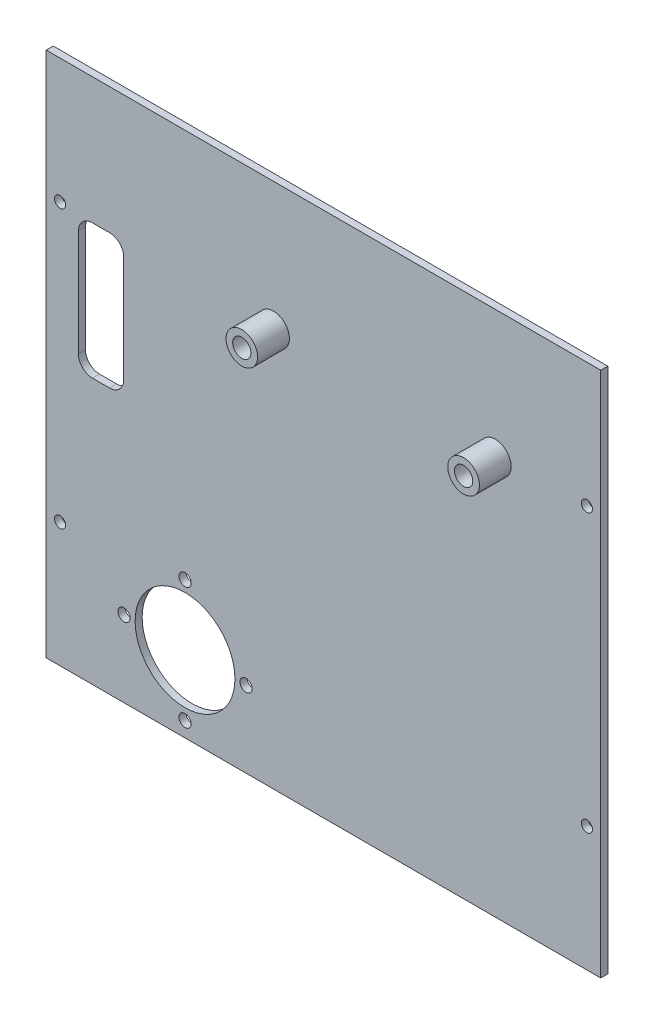
ISO-10303-21;
HEADER;
FILE_DESCRIPTION(('STEP AP214'),'2;1');
FILE_NAME('part.step','',(''),(''),'','','');
FILE_SCHEMA(('AUTOMOTIVE_DESIGN { 1 0 10303 214 1 1 1 1 }'));
ENDSEC;
DATA;
#1=APPLICATION_CONTEXT('core data for automotive mechanical design processes');
#2=APPLICATION_PROTOCOL_DEFINITION('international standard','automotive_design',2000,#1);
#3=PRODUCT_CONTEXT('',#1,'mechanical');
#4=PRODUCT('Part','Part','',(#3));
#5=PRODUCT_RELATED_PRODUCT_CATEGORY('part','',(#4));
#6=PRODUCT_DEFINITION_FORMATION('','',#4);
#7=PRODUCT_DEFINITION_CONTEXT('part definition',#1,'design');
#8=PRODUCT_DEFINITION('design','',#6,#7);
#9=PRODUCT_DEFINITION_SHAPE('','',#8);
#10=(LENGTH_UNIT() NAMED_UNIT(*) SI_UNIT(.MILLI.,.METRE.));
#11=(NAMED_UNIT(*) PLANE_ANGLE_UNIT() SI_UNIT($,.RADIAN.));
#12=(NAMED_UNIT(*) SI_UNIT($,.STERADIAN.) SOLID_ANGLE_UNIT());
#13=UNCERTAINTY_MEASURE_WITH_UNIT(LENGTH_MEASURE(1.E-05),#10,'distance_accuracy_value','');
#14=(GEOMETRIC_REPRESENTATION_CONTEXT(3) GLOBAL_UNCERTAINTY_ASSIGNED_CONTEXT((#13)) GLOBAL_UNIT_ASSIGNED_CONTEXT((#10,
#11,#12)) REPRESENTATION_CONTEXT('',''));
#15=CARTESIAN_POINT('',(0.,0.,0.));
#16=DIRECTION('',(0.,0.,1.));
#17=DIRECTION('',(1.,0.,0.));
#18=AXIS2_PLACEMENT_3D('',#15,#16,#17);
#19=CARTESIAN_POINT('',(0.,0.,1.27));
#20=DIRECTION('',(0.,0.,1.));
#21=DIRECTION('',(1.,0.,0.));
#22=AXIS2_PLACEMENT_3D('',#19,#20,#21);
#23=PLANE('',#22);
#24=CARTESIAN_POINT('',(11.4355880883671,51.6657368288596,1.27));
#25=DIRECTION('',(0.,0.,1.));
#26=DIRECTION('',(1.,0.,0.));
#27=AXIS2_PLACEMENT_3D('',#24,#25,#26);
#28=CIRCLE('',#27,2.54);
#29=CARTESIAN_POINT('',(11.4355880883671,49.1257368288596,1.27));
#30=VERTEX_POINT('',#29);
#31=CARTESIAN_POINT('',(13.9755880883671,51.6657368288596,1.27));
#32=VERTEX_POINT('',#31);
#33=EDGE_CURVE('E72',#30,#32,#28,.T.);
#34=ORIENTED_EDGE('',*,*,#33,.F.);
#35=DIRECTION('',(1.,0.,0.));
#36=VECTOR('',#35,1.);
#37=CARTESIAN_POINT('',(11.4355880883671,49.1257368288596,1.27));
#38=LINE('',#37,#36);
#39=CARTESIAN_POINT('',(8.34110605066527,49.1257368288596,1.27));
#40=VERTEX_POINT('',#39);
#41=EDGE_CURVE('E179',#40,#30,#38,.T.);
#42=ORIENTED_EDGE('',*,*,#41,.F.);
#43=CARTESIAN_POINT('',(8.34110605066525,51.6657368288596,1.27));
#44=DIRECTION('',(0.,0.,1.));
#45=DIRECTION('',(1.,0.,0.));
#46=AXIS2_PLACEMENT_3D('',#43,#44,#45);
#47=CIRCLE('',#46,2.54);
#48=CARTESIAN_POINT('',(5.80110605066525,51.6657368288596,1.27));
#49=VERTEX_POINT('',#48);
#50=EDGE_CURVE('E176',#49,#40,#47,.T.);
#51=ORIENTED_EDGE('',*,*,#50,.F.);
#52=DIRECTION('',(0.,-1.,0.));
#53=VECTOR('',#52,1.);
#54=CARTESIAN_POINT('',(5.80110605066525,51.6657368288596,1.27));
#55=LINE('',#54,#53);
#56=CARTESIAN_POINT('',(5.8011060506654,70.8373046116891,1.27));
#57=VERTEX_POINT('',#56);
#58=EDGE_CURVE('E173',#57,#49,#55,.T.);
#59=ORIENTED_EDGE('',*,*,#58,.F.);
#60=CARTESIAN_POINT('',(8.3411060506654,70.8373046116891,1.27));
#61=DIRECTION('',(0.,0.,1.));
#62=DIRECTION('',(1.,0.,0.));
#63=AXIS2_PLACEMENT_3D('',#60,#61,#62);
#64=CIRCLE('',#63,2.54);
#65=CARTESIAN_POINT('',(8.3411060506654,73.3773046116891,1.27));
#66=VERTEX_POINT('',#65);
#67=EDGE_CURVE('E167',#66,#57,#64,.T.);
#68=ORIENTED_EDGE('',*,*,#67,.F.);
#69=DIRECTION('',(-1.,0.,0.));
#70=VECTOR('',#69,1.);
#71=CARTESIAN_POINT('',(8.3411060506654,73.3773046116891,1.27));
#72=LINE('',#71,#70);
#73=CARTESIAN_POINT('',(11.435588088367,73.3773046116891,1.27));
#74=VERTEX_POINT('',#73);
#75=EDGE_CURVE('E165',#74,#66,#72,.T.);
#76=ORIENTED_EDGE('',*,*,#75,.F.);
#77=CARTESIAN_POINT('',(11.435588088367,70.8373046116891,1.27));
#78=DIRECTION('',(0.,0.,1.));
#79=DIRECTION('',(-1.,0.,0.));
#80=AXIS2_PLACEMENT_3D('',#77,#78,#79);
#81=CIRCLE('',#80,2.54);
#82=CARTESIAN_POINT('',(13.975588088367,70.8373046116891,1.27));
#83=VERTEX_POINT('',#82);
#84=EDGE_CURVE('E149',#83,#74,#81,.T.);
#85=ORIENTED_EDGE('',*,*,#84,.F.);
#86=DIRECTION('',(0.,1.,0.));
#87=VECTOR('',#86,1.);
#88=CARTESIAN_POINT('',(13.975588088367,70.8373046116891,1.27));
#89=LINE('',#88,#87);
#90=EDGE_CURVE('E158',#32,#83,#89,.T.);
#91=ORIENTED_EDGE('',*,*,#90,.F.);
#92=EDGE_LOOP('',(#34,#42,#51,#59,#68,#76,#85,#91));
#93=FACE_BOUND('',#92,.T.);
#94=CARTESIAN_POINT('',(97.5,73.73,1.27));
#95=DIRECTION('',(0.,0.,1.));
#96=DIRECTION('',(1.,0.,0.));
#97=AXIS2_PLACEMENT_3D('',#94,#95,#96);
#98=CIRCLE('',#97,1.00000000000001);
#99=CARTESIAN_POINT('',(98.5,73.73,1.27));
#100=VERTEX_POINT('',#99);
#101=EDGE_CURVE('E215',#100,#100,#98,.T.);
#102=ORIENTED_EDGE('',*,*,#101,.F.);
#103=EDGE_LOOP('',(#102));
#104=FACE_BOUND('',#103,.T.);
#105=CARTESIAN_POINT('',(97.5,23.73,1.27));
#106=DIRECTION('',(0.,0.,1.));
#107=DIRECTION('',(1.,0.,0.));
#108=AXIS2_PLACEMENT_3D('',#105,#106,#107);
#109=CIRCLE('',#108,0.999999999999998);
#110=CARTESIAN_POINT('',(98.5,23.73,1.27));
#111=VERTEX_POINT('',#110);
#112=EDGE_CURVE('E212',#111,#111,#109,.T.);
#113=ORIENTED_EDGE('',*,*,#112,.F.);
#114=EDGE_LOOP('',(#113));
#115=FACE_BOUND('',#114,.T.);
#116=CARTESIAN_POINT('',(2.49999999999999,23.73,1.27));
#117=DIRECTION('',(0.,0.,1.));
#118=DIRECTION('',(1.,0.,0.));
#119=AXIS2_PLACEMENT_3D('',#116,#117,#118);
#120=CIRCLE('',#119,0.999999999999999);
#121=CARTESIAN_POINT('',(3.49999999999999,23.73,1.27));
#122=VERTEX_POINT('',#121);
#123=EDGE_CURVE('E209',#122,#122,#120,.T.);
#124=ORIENTED_EDGE('',*,*,#123,.F.);
#125=EDGE_LOOP('',(#124));
#126=FACE_BOUND('',#125,.T.);
#127=CARTESIAN_POINT('',(2.5,73.73,1.27));
#128=DIRECTION('',(0.,0.,1.));
#129=DIRECTION('',(1.,0.,0.));
#130=AXIS2_PLACEMENT_3D('',#127,#128,#129);
#131=CIRCLE('',#130,1.);
#132=CARTESIAN_POINT('',(3.5,73.73,1.27));
#133=VERTEX_POINT('',#132);
#134=EDGE_CURVE('E206',#133,#133,#131,.T.);
#135=ORIENTED_EDGE('',*,*,#134,.F.);
#136=EDGE_LOOP('',(#135));
#137=FACE_BOUND('',#136,.T.);
#138=CARTESIAN_POINT('',(25.031645401981,4.,1.27));
#139=DIRECTION('',(0.,0.,1.));
#140=DIRECTION('',(1.,0.,0.));
#141=AXIS2_PLACEMENT_3D('',#138,#139,#140);
#142=CIRCLE('',#141,1.1);
#143=CARTESIAN_POINT('',(26.131645401981,4.,1.27));
#144=VERTEX_POINT('',#143);
#145=EDGE_CURVE('E245',#144,#144,#142,.T.);
#146=ORIENTED_EDGE('',*,*,#145,.F.);
#147=EDGE_LOOP('',(#146));
#148=FACE_BOUND('',#147,.T.);
#149=DIRECTION('',(0.,1.,0.));
#150=VECTOR('',#149,1.);
#151=CARTESIAN_POINT('',(100.,0.,1.27));
#152=LINE('',#151,#150);
#153=CARTESIAN_POINT('',(100.,1.27,1.27));
#154=VERTEX_POINT('',#153);
#155=CARTESIAN_POINT('',(100.,96.19,1.27));
#156=VERTEX_POINT('',#155);
#157=EDGE_CURVE('E275',#154,#156,#152,.T.);
#158=ORIENTED_EDGE('',*,*,#157,.T.);
#159=DIRECTION('',(-1.,0.,0.));
#160=VECTOR('',#159,1.);
#161=CARTESIAN_POINT('',(0.,96.19,1.27));
#162=LINE('',#161,#160);
#163=CARTESIAN_POINT('',(0.,96.19,1.27));
#164=VERTEX_POINT('',#163);
#165=EDGE_CURVE('E278',#156,#164,#162,.T.);
#166=ORIENTED_EDGE('',*,*,#165,.T.);
#167=DIRECTION('',(0.,1.,0.));
#168=VECTOR('',#167,1.);
#169=CARTESIAN_POINT('',(0.,0.,1.27));
#170=LINE('',#169,#168);
#171=CARTESIAN_POINT('',(0.,1.27,1.27));
#172=VERTEX_POINT('',#171);
#173=EDGE_CURVE('E281',#172,#164,#170,.T.);
#174=ORIENTED_EDGE('',*,*,#173,.F.);
#175=DIRECTION('',(1.,0.,0.));
#176=VECTOR('',#175,1.);
#177=CARTESIAN_POINT('',(0.,1.27,1.27));
#178=LINE('',#177,#176);
#179=EDGE_CURVE('E284',#172,#154,#178,.T.);
#180=ORIENTED_EDGE('',*,*,#179,.T.);
#181=EDGE_LOOP('',(#158,#166,#174,#180));
#182=FACE_BOUND('',#181,.T.);
#183=CARTESIAN_POINT('',(81.00001,73.0548198698189,1.27));
#184=DIRECTION('',(0.,0.,1.));
#185=DIRECTION('',(1.,0.,0.));
#186=AXIS2_PLACEMENT_3D('',#183,#184,#185);
#187=CIRCLE('',#186,2.84999999999999);
#188=CARTESIAN_POINT('',(83.85001,73.0548198698189,1.27));
#189=VERTEX_POINT('',#188);
#190=EDGE_CURVE('E268',#189,#189,#187,.T.);
#191=ORIENTED_EDGE('',*,*,#190,.F.);
#192=EDGE_LOOP('',(#191));
#193=FACE_BOUND('',#192,.T.);
#194=CARTESIAN_POINT('',(41.00001,73.0548198698189,1.27));
#195=DIRECTION('',(0.,0.,1.));
#196=DIRECTION('',(1.,0.,0.));
#197=AXIS2_PLACEMENT_3D('',#194,#195,#196);
#198=CIRCLE('',#197,2.85000000000001);
#199=CARTESIAN_POINT('',(43.85001,73.0548198698189,1.27));
#200=VERTEX_POINT('',#199);
#201=EDGE_CURVE('E264',#200,#200,#198,.T.);
#202=ORIENTED_EDGE('',*,*,#201,.F.);
#203=EDGE_LOOP('',(#202));
#204=FACE_BOUND('',#203,.T.);
#205=CARTESIAN_POINT('',(14.031645401981,15.,1.27));
#206=DIRECTION('',(0.,0.,1.));
#207=DIRECTION('',(1.,0.,0.));
#208=AXIS2_PLACEMENT_3D('',#205,#206,#207);
#209=CIRCLE('',#208,1.1);
#210=CARTESIAN_POINT('',(15.131645401981,15.,1.27));
#211=VERTEX_POINT('',#210);
#212=EDGE_CURVE('E222',#211,#211,#209,.T.);
#213=ORIENTED_EDGE('',*,*,#212,.F.);
#214=EDGE_LOOP('',(#213));
#215=FACE_BOUND('',#214,.T.);
#216=CARTESIAN_POINT('',(25.031645401981,26.,1.27));
#217=DIRECTION('',(0.,0.,1.));
#218=DIRECTION('',(1.,0.,0.));
#219=AXIS2_PLACEMENT_3D('',#216,#217,#218);
#220=CIRCLE('',#219,1.1);
#221=CARTESIAN_POINT('',(26.131645401981,26.,1.27));
#222=VERTEX_POINT('',#221);
#223=EDGE_CURVE('E236',#222,#222,#220,.T.);
#224=ORIENTED_EDGE('',*,*,#223,.F.);
#225=EDGE_LOOP('',(#224));
#226=FACE_BOUND('',#225,.T.);
#227=CARTESIAN_POINT('',(36.031645401981,15.,1.27));
#228=DIRECTION('',(0.,0.,1.));
#229=DIRECTION('',(1.,0.,0.));
#230=AXIS2_PLACEMENT_3D('',#227,#228,#229);
#231=CIRCLE('',#230,1.09999999999999);
#232=CARTESIAN_POINT('',(37.131645401981,15.,1.27));
#233=VERTEX_POINT('',#232);
#234=EDGE_CURVE('E239',#233,#233,#231,.T.);
#235=ORIENTED_EDGE('',*,*,#234,.F.);
#236=EDGE_LOOP('',(#235));
#237=FACE_BOUND('',#236,.T.);
#238=CARTESIAN_POINT('',(25.031645401981,15.,1.27));
#239=DIRECTION('',(0.,0.,1.));
#240=DIRECTION('',(1.,0.,0.));
#241=AXIS2_PLACEMENT_3D('',#238,#239,#240);
#242=CIRCLE('',#241,9.);
#243=CARTESIAN_POINT('',(34.031645401981,15.,1.27));
#244=VERTEX_POINT('',#243);
#245=EDGE_CURVE('E242',#244,#244,#242,.F.);
#246=ORIENTED_EDGE('',*,*,#245,.T.);
#247=EDGE_LOOP('',(#246));
#248=FACE_BOUND('',#247,.T.);
#249=ADVANCED_FACE('F57',(#93,#104,#115,#126,#137,#148,#182,#193,#204,#215,#226,#237,#248),#23,.T.);
#250=CARTESIAN_POINT('',(0.,0.,0.));
#251=DIRECTION('',(0.,0.,1.));
#252=DIRECTION('',(1.,0.,0.));
#253=AXIS2_PLACEMENT_3D('',#250,#251,#252);
#254=PLANE('',#253);
#255=DIRECTION('',(1.,0.,0.));
#256=VECTOR('',#255,1.);
#257=CARTESIAN_POINT('',(0.,49.1257368288596,0.));
#258=LINE('',#257,#256);
#259=CARTESIAN_POINT('',(8.34110605066527,49.1257368288596,0.));
#260=VERTEX_POINT('',#259);
#261=CARTESIAN_POINT('',(11.4355880883671,49.1257368288596,0.));
#262=VERTEX_POINT('',#261);
#263=EDGE_CURVE('E65',#260,#262,#258,.T.);
#264=ORIENTED_EDGE('',*,*,#263,.T.);
#265=CARTESIAN_POINT('',(11.4355880883671,51.6657368288596,0.));
#266=DIRECTION('',(0.,0.,1.));
#267=DIRECTION('',(1.,0.,0.));
#268=AXIS2_PLACEMENT_3D('',#265,#266,#267);
#269=CIRCLE('',#268,2.54);
#270=CARTESIAN_POINT('',(13.9755880883671,51.6657368288596,0.));
#271=VERTEX_POINT('',#270);
#272=EDGE_CURVE('E12',#262,#271,#269,.T.);
#273=ORIENTED_EDGE('',*,*,#272,.T.);
#274=DIRECTION('',(0.,1.,0.));
#275=VECTOR('',#274,1.);
#276=CARTESIAN_POINT('',(13.9755880883675,1.138112590472E-13,0.));
#277=LINE('',#276,#275);
#278=CARTESIAN_POINT('',(13.975588088367,70.8373046116891,0.));
#279=VERTEX_POINT('',#278);
#280=EDGE_CURVE('E267',#271,#279,#277,.T.);
#281=ORIENTED_EDGE('',*,*,#280,.T.);
#282=CARTESIAN_POINT('',(11.435588088367,70.8373046116891,0.));
#283=DIRECTION('',(0.,0.,1.));
#284=DIRECTION('',(1.,0.,0.));
#285=AXIS2_PLACEMENT_3D('',#282,#283,#284);
#286=CIRCLE('',#285,2.54);
#287=CARTESIAN_POINT('',(11.435588088367,73.3773046116891,0.));
#288=VERTEX_POINT('',#287);
#289=EDGE_CURVE('E152',#279,#288,#286,.T.);
#290=ORIENTED_EDGE('',*,*,#289,.T.);
#291=DIRECTION('',(-1.,0.,0.));
#292=VECTOR('',#291,1.);
#293=CARTESIAN_POINT('',(0.,73.3773046116891,0.));
#294=LINE('',#293,#292);
#295=CARTESIAN_POINT('',(8.3411060506654,73.3773046116891,0.));
#296=VERTEX_POINT('',#295);
#297=EDGE_CURVE('E306',#288,#296,#294,.T.);
#298=ORIENTED_EDGE('',*,*,#297,.T.);
#299=CARTESIAN_POINT('',(8.3411060506654,70.8373046116891,0.));
#300=DIRECTION('',(0.,0.,1.));
#301=DIRECTION('',(1.,0.,0.));
#302=AXIS2_PLACEMENT_3D('',#299,#300,#301);
#303=CIRCLE('',#302,2.54);
#304=CARTESIAN_POINT('',(5.8011060506654,70.8373046116891,0.));
#305=VERTEX_POINT('',#304);
#306=EDGE_CURVE('E309',#296,#305,#303,.T.);
#307=ORIENTED_EDGE('',*,*,#306,.T.);
#308=DIRECTION('',(0.,-1.,0.));
#309=VECTOR('',#308,1.);
#310=CARTESIAN_POINT('',(5.80110605066483,0.,0.));
#311=LINE('',#310,#309);
#312=CARTESIAN_POINT('',(5.80110605066525,51.6657368288596,0.));
#313=VERTEX_POINT('',#312);
#314=EDGE_CURVE('E312',#305,#313,#311,.T.);
#315=ORIENTED_EDGE('',*,*,#314,.T.);
#316=CARTESIAN_POINT('',(8.34110605066525,51.6657368288596,0.));
#317=DIRECTION('',(0.,0.,1.));
#318=DIRECTION('',(1.,0.,0.));
#319=AXIS2_PLACEMENT_3D('',#316,#317,#318);
#320=CIRCLE('',#319,2.54);
#321=EDGE_CURVE('E315',#313,#260,#320,.T.);
#322=ORIENTED_EDGE('',*,*,#321,.T.);
#323=EDGE_LOOP('',(#264,#273,#281,#290,#298,#307,#315,#322));
#324=FACE_BOUND('',#323,.T.);
#325=CARTESIAN_POINT('',(97.5,73.73,0.));
#326=DIRECTION('',(0.,0.,-1.));
#327=DIRECTION('',(-1.,0.,0.));
#328=AXIS2_PLACEMENT_3D('',#325,#326,#327);
#329=CIRCLE('',#328,1.00000000000001);
#330=CARTESIAN_POINT('',(96.5,73.73,0.));
#331=VERTEX_POINT('',#330);
#332=EDGE_CURVE('E184',#331,#331,#329,.T.);
#333=ORIENTED_EDGE('',*,*,#332,.F.);
#334=EDGE_LOOP('',(#333));
#335=FACE_BOUND('',#334,.T.);
#336=CARTESIAN_POINT('',(97.5,23.73,0.));
#337=DIRECTION('',(0.,0.,-1.));
#338=DIRECTION('',(-1.,0.,0.));
#339=AXIS2_PLACEMENT_3D('',#336,#337,#338);
#340=CIRCLE('',#339,0.999999999999998);
#341=CARTESIAN_POINT('',(96.5,23.73,0.));
#342=VERTEX_POINT('',#341);
#343=EDGE_CURVE('E199',#342,#342,#340,.T.);
#344=ORIENTED_EDGE('',*,*,#343,.F.);
#345=EDGE_LOOP('',(#344));
#346=FACE_BOUND('',#345,.T.);
#347=CARTESIAN_POINT('',(2.49999999999999,23.73,0.));
#348=DIRECTION('',(0.,0.,-1.));
#349=DIRECTION('',(1.,0.,0.));
#350=AXIS2_PLACEMENT_3D('',#347,#348,#349);
#351=CIRCLE('',#350,0.999999999999999);
#352=CARTESIAN_POINT('',(3.49999999999999,23.73,0.));
#353=VERTEX_POINT('',#352);
#354=EDGE_CURVE('E195',#353,#353,#351,.T.);
#355=ORIENTED_EDGE('',*,*,#354,.F.);
#356=EDGE_LOOP('',(#355));
#357=FACE_BOUND('',#356,.T.);
#358=CARTESIAN_POINT('',(2.5,73.73,0.));
#359=DIRECTION('',(0.,0.,-1.));
#360=DIRECTION('',(1.,0.,0.));
#361=AXIS2_PLACEMENT_3D('',#358,#359,#360);
#362=CIRCLE('',#361,1.);
#363=CARTESIAN_POINT('',(3.5,73.73,0.));
#364=VERTEX_POINT('',#363);
#365=EDGE_CURVE('E198',#364,#364,#362,.T.);
#366=ORIENTED_EDGE('',*,*,#365,.F.);
#367=EDGE_LOOP('',(#366));
#368=FACE_BOUND('',#367,.T.);
#369=CARTESIAN_POINT('',(25.031645401981,4.,0.));
#370=DIRECTION('',(0.,0.,-1.));
#371=DIRECTION('',(-1.,0.,0.));
#372=AXIS2_PLACEMENT_3D('',#369,#370,#371);
#373=CIRCLE('',#372,1.1);
#374=CARTESIAN_POINT('',(23.931645401981,4.,0.));
#375=VERTEX_POINT('',#374);
#376=EDGE_CURVE('E219',#375,#375,#373,.T.);
#377=ORIENTED_EDGE('',*,*,#376,.F.);
#378=EDGE_LOOP('',(#377));
#379=FACE_BOUND('',#378,.T.);
#380=CARTESIAN_POINT('',(36.031645401981,15.,0.));
#381=DIRECTION('',(0.,0.,-1.));
#382=DIRECTION('',(-1.,0.,0.));
#383=AXIS2_PLACEMENT_3D('',#380,#381,#382);
#384=CIRCLE('',#383,1.09999999999999);
#385=CARTESIAN_POINT('',(34.931645401981,15.,0.));
#386=VERTEX_POINT('',#385);
#387=EDGE_CURVE('E224',#386,#386,#384,.T.);
#388=ORIENTED_EDGE('',*,*,#387,.F.);
#389=EDGE_LOOP('',(#388));
#390=FACE_BOUND('',#389,.T.);
#391=CARTESIAN_POINT('',(25.031645401981,26.,0.));
#392=DIRECTION('',(0.,0.,-1.));
#393=DIRECTION('',(-1.,0.,0.));
#394=AXIS2_PLACEMENT_3D('',#391,#392,#393);
#395=CIRCLE('',#394,1.1);
#396=CARTESIAN_POINT('',(23.931645401981,26.,0.));
#397=VERTEX_POINT('',#396);
#398=EDGE_CURVE('E227',#397,#397,#395,.T.);
#399=ORIENTED_EDGE('',*,*,#398,.F.);
#400=EDGE_LOOP('',(#399));
#401=FACE_BOUND('',#400,.T.);
#402=CARTESIAN_POINT('',(14.031645401981,15.,0.));
#403=DIRECTION('',(0.,0.,-1.));
#404=DIRECTION('',(-1.,0.,0.));
#405=AXIS2_PLACEMENT_3D('',#402,#403,#404);
#406=CIRCLE('',#405,1.1);
#407=CARTESIAN_POINT('',(12.931645401981,15.,0.));
#408=VERTEX_POINT('',#407);
#409=EDGE_CURVE('E223',#408,#408,#406,.T.);
#410=ORIENTED_EDGE('',*,*,#409,.F.);
#411=EDGE_LOOP('',(#410));
#412=FACE_BOUND('',#411,.T.);
#413=CARTESIAN_POINT('',(81.00001,73.0548198698189,0.));
#414=DIRECTION('',(0.,0.,1.));
#415=DIRECTION('',(1.,0.,0.));
#416=AXIS2_PLACEMENT_3D('',#413,#414,#415);
#417=CIRCLE('',#416,1.65);
#418=CARTESIAN_POINT('',(82.65001,73.0548198698189,0.));
#419=VERTEX_POINT('',#418);
#420=EDGE_CURVE('E251',#419,#419,#417,.T.);
#421=ORIENTED_EDGE('',*,*,#420,.T.);
#422=EDGE_LOOP('',(#421));
#423=FACE_BOUND('',#422,.T.);
#424=CARTESIAN_POINT('',(41.00001,73.0548198698189,0.));
#425=DIRECTION('',(0.,0.,1.));
#426=DIRECTION('',(1.,0.,0.));
#427=AXIS2_PLACEMENT_3D('',#424,#425,#426);
#428=CIRCLE('',#427,1.65);
#429=CARTESIAN_POINT('',(42.65001,73.0548198698189,0.));
#430=VERTEX_POINT('',#429);
#431=EDGE_CURVE('E257',#430,#430,#428,.T.);
#432=ORIENTED_EDGE('',*,*,#431,.T.);
#433=EDGE_LOOP('',(#432));
#434=FACE_BOUND('',#433,.T.);
#435=DIRECTION('',(0.,1.,0.));
#436=VECTOR('',#435,1.);
#437=CARTESIAN_POINT('',(100.,0.,0.));
#438=LINE('',#437,#436);
#439=CARTESIAN_POINT('',(100.,1.27,0.));
#440=VERTEX_POINT('',#439);
#441=CARTESIAN_POINT('',(100.,96.19,0.));
#442=VERTEX_POINT('',#441);
#443=EDGE_CURVE('E271',#440,#442,#438,.T.);
#444=ORIENTED_EDGE('',*,*,#443,.F.);
#445=DIRECTION('',(1.,0.,0.));
#446=VECTOR('',#445,1.);
#447=CARTESIAN_POINT('',(0.,1.27,0.));
#448=LINE('',#447,#446);
#449=CARTESIAN_POINT('',(0.,1.27,0.));
#450=VERTEX_POINT('',#449);
#451=EDGE_CURVE('E279',#450,#440,#448,.T.);
#452=ORIENTED_EDGE('',*,*,#451,.F.);
#453=DIRECTION('',(0.,1.,0.));
#454=VECTOR('',#453,1.);
#455=CARTESIAN_POINT('',(0.,0.,0.));
#456=LINE('',#455,#454);
#457=CARTESIAN_POINT('',(0.,96.19,0.));
#458=VERTEX_POINT('',#457);
#459=EDGE_CURVE('E292',#450,#458,#456,.T.);
#460=ORIENTED_EDGE('',*,*,#459,.T.);
#461=DIRECTION('',(-1.,0.,0.));
#462=VECTOR('',#461,1.);
#463=CARTESIAN_POINT('',(0.,96.19,0.));
#464=LINE('',#463,#462);
#465=EDGE_CURVE('E289',#442,#458,#464,.T.);
#466=ORIENTED_EDGE('',*,*,#465,.F.);
#467=EDGE_LOOP('',(#444,#452,#460,#466));
#468=FACE_BOUND('',#467,.T.);
#469=CARTESIAN_POINT('',(25.031645401981,15.,0.));
#470=DIRECTION('',(0.,0.,-1.));
#471=DIRECTION('',(-1.,0.,0.));
#472=AXIS2_PLACEMENT_3D('',#469,#470,#471);
#473=CIRCLE('',#472,9.);
#474=CARTESIAN_POINT('',(16.031645401981,15.,0.));
#475=VERTEX_POINT('',#474);
#476=EDGE_CURVE('E218',#475,#475,#473,.F.);
#477=ORIENTED_EDGE('',*,*,#476,.T.);
#478=EDGE_LOOP('',(#477));
#479=FACE_BOUND('',#478,.T.);
#480=ADVANCED_FACE('F319',(#324,#335,#346,#357,#368,#379,#390,#401,#412,#423,#434,#468,#479),
#254,.F.);
#481=CARTESIAN_POINT('',(100.,0.,1.27));
#482=DIRECTION('',(-1.,0.,0.));
#483=DIRECTION('',(0.,0.,1.));
#484=AXIS2_PLACEMENT_3D('',#481,#482,#483);
#485=PLANE('',#484);
#486=ORIENTED_EDGE('',*,*,#443,.T.);
#487=DIRECTION('',(0.,0.,-1.));
#488=VECTOR('',#487,1.);
#489=CARTESIAN_POINT('',(100.,96.19,1.27));
#490=LINE('',#489,#488);
#491=EDGE_CURVE('E274',#156,#442,#490,.T.);
#492=ORIENTED_EDGE('',*,*,#491,.F.);
#493=ORIENTED_EDGE('',*,*,#157,.F.);
#494=DIRECTION('',(0.,0.,-1.));
#495=VECTOR('',#494,1.);
#496=CARTESIAN_POINT('',(100.,1.27,1.27));
#497=LINE('',#496,#495);
#498=EDGE_CURVE('E286',#154,#440,#497,.T.);
#499=ORIENTED_EDGE('',*,*,#498,.T.);
#500=EDGE_LOOP('',(#486,#492,#493,#499));
#501=FACE_BOUND('',#500,.T.);
#502=ADVANCED_FACE('F59',(#501),#485,.F.);
#503=CARTESIAN_POINT('',(0.,96.19,1.27));
#504=DIRECTION('',(0.,-1.,0.));
#505=DIRECTION('',(0.,0.,-1.));
#506=AXIS2_PLACEMENT_3D('',#503,#504,#505);
#507=PLANE('',#506);
#508=ORIENTED_EDGE('',*,*,#465,.T.);
#509=DIRECTION('',(0.,0.,-1.));
#510=VECTOR('',#509,1.);
#511=CARTESIAN_POINT('',(0.,96.19,1.27));
#512=LINE('',#511,#510);
#513=EDGE_CURVE('E300',#164,#458,#512,.T.);
#514=ORIENTED_EDGE('',*,*,#513,.F.);
#515=ORIENTED_EDGE('',*,*,#165,.F.);
#516=ORIENTED_EDGE('',*,*,#491,.T.);
#517=EDGE_LOOP('',(#508,#514,#515,#516));
#518=FACE_BOUND('',#517,.T.);
#519=ADVANCED_FACE('F369',(#518),#507,.F.);
#520=CARTESIAN_POINT('',(0.,0.,1.27));
#521=DIRECTION('',(-1.,0.,0.));
#522=DIRECTION('',(0.,0.,1.));
#523=AXIS2_PLACEMENT_3D('',#520,#521,#522);
#524=PLANE('',#523);
#525=ORIENTED_EDGE('',*,*,#459,.F.);
#526=DIRECTION('',(0.,0.,-1.));
#527=VECTOR('',#526,1.);
#528=CARTESIAN_POINT('',(0.,1.27,1.27));
#529=LINE('',#528,#527);
#530=EDGE_CURVE('E298',#172,#450,#529,.T.);
#531=ORIENTED_EDGE('',*,*,#530,.F.);
#532=ORIENTED_EDGE('',*,*,#173,.T.);
#533=ORIENTED_EDGE('',*,*,#513,.T.);
#534=EDGE_LOOP('',(#525,#531,#532,#533));
#535=FACE_BOUND('',#534,.T.);
#536=ADVANCED_FACE('F366',(#535),#524,.T.);
#537=CARTESIAN_POINT('',(0.,1.27,1.27));
#538=DIRECTION('',(0.,1.,0.));
#539=DIRECTION('',(0.,0.,1.));
#540=AXIS2_PLACEMENT_3D('',#537,#538,#539);
#541=PLANE('',#540);
#542=ORIENTED_EDGE('',*,*,#451,.T.);
#543=ORIENTED_EDGE('',*,*,#498,.F.);
#544=ORIENTED_EDGE('',*,*,#179,.F.);
#545=ORIENTED_EDGE('',*,*,#530,.T.);
#546=EDGE_LOOP('',(#542,#543,#544,#545));
#547=FACE_BOUND('',#546,.T.);
#548=ADVANCED_FACE('F363',(#547),#541,.F.);
#549=CARTESIAN_POINT('',(81.00001,73.0548198698189,7.));
#550=DIRECTION('',(0.,0.,-1.));
#551=DIRECTION('',(-1.,0.,0.));
#552=AXIS2_PLACEMENT_3D('',#549,#550,#551);
#553=CYLINDRICAL_SURFACE('',#552,2.84999999999999);
#554=ORIENTED_EDGE('',*,*,#190,.T.);
#555=EDGE_LOOP('',(#554));
#556=FACE_BOUND('',#555,.T.);
#557=CARTESIAN_POINT('',(81.00001,73.0548198698189,7.));
#558=DIRECTION('',(0.,0.,-1.));
#559=DIRECTION('',(-1.,0.,0.));
#560=AXIS2_PLACEMENT_3D('',#557,#558,#559);
#561=CIRCLE('',#560,2.84999999999999);
#562=CARTESIAN_POINT('',(78.15001,73.0548198698189,7.));
#563=VERTEX_POINT('',#562);
#564=EDGE_CURVE('E263',#563,#563,#561,.T.);
#565=ORIENTED_EDGE('',*,*,#564,.T.);
#566=EDGE_LOOP('',(#565));
#567=FACE_BOUND('',#566,.T.);
#568=ADVANCED_FACE('F360',(#556,#567),#553,.T.);
#569=CARTESIAN_POINT('',(0.,0.,7.));
#570=DIRECTION('',(0.,0.,-1.));
#571=DIRECTION('',(-1.,0.,0.));
#572=AXIS2_PLACEMENT_3D('',#569,#570,#571);
#573=PLANE('',#572);
#574=CARTESIAN_POINT('',(81.00001,73.0548198698189,7.));
#575=DIRECTION('',(0.,0.,1.));
#576=DIRECTION('',(1.,0.,0.));
#577=AXIS2_PLACEMENT_3D('',#574,#575,#576);
#578=CIRCLE('',#577,1.64999999999998);
#579=CARTESIAN_POINT('',(82.65001,73.0548198698189,7.));
#580=VERTEX_POINT('',#579);
#581=EDGE_CURVE('E248',#580,#580,#578,.T.);
#582=ORIENTED_EDGE('',*,*,#581,.F.);
#583=EDGE_LOOP('',(#582));
#584=FACE_BOUND('',#583,.T.);
#585=ORIENTED_EDGE('',*,*,#564,.F.);
#586=EDGE_LOOP('',(#585));
#587=FACE_BOUND('',#586,.T.);
#588=ADVANCED_FACE('F441',(#584,#587),#573,.F.);
#589=CARTESIAN_POINT('',(41.00001,73.0548198698189,7.));
#590=DIRECTION('',(0.,0.,-1.));
#591=DIRECTION('',(-1.,0.,0.));
#592=AXIS2_PLACEMENT_3D('',#589,#590,#591);
#593=CYLINDRICAL_SURFACE('',#592,2.85000000000001);
#594=ORIENTED_EDGE('',*,*,#201,.T.);
#595=EDGE_LOOP('',(#594));
#596=FACE_BOUND('',#595,.T.);
#597=CARTESIAN_POINT('',(41.00001,73.0548198698189,7.));
#598=DIRECTION('',(0.,0.,-1.));
#599=DIRECTION('',(-1.,0.,0.));
#600=AXIS2_PLACEMENT_3D('',#597,#598,#599);
#601=CIRCLE('',#600,2.85000000000001);
#602=CARTESIAN_POINT('',(38.15001,73.0548198698189,7.));
#603=VERTEX_POINT('',#602);
#604=EDGE_CURVE('E260',#603,#603,#601,.T.);
#605=ORIENTED_EDGE('',*,*,#604,.T.);
#606=EDGE_LOOP('',(#605));
#607=FACE_BOUND('',#606,.T.);
#608=ADVANCED_FACE('F438',(#596,#607),#593,.T.);
#609=CARTESIAN_POINT('',(0.,0.,7.));
#610=DIRECTION('',(0.,0.,-1.));
#611=DIRECTION('',(-1.,0.,0.));
#612=AXIS2_PLACEMENT_3D('',#609,#610,#611);
#613=PLANE('',#612);
#614=CARTESIAN_POINT('',(41.00001,73.0548198698189,7.));
#615=DIRECTION('',(0.,0.,1.));
#616=DIRECTION('',(1.,0.,0.));
#617=AXIS2_PLACEMENT_3D('',#614,#615,#616);
#618=CIRCLE('',#617,1.64999999999998);
#619=CARTESIAN_POINT('',(42.65001,73.0548198698189,7.));
#620=VERTEX_POINT('',#619);
#621=EDGE_CURVE('E254',#620,#620,#618,.T.);
#622=ORIENTED_EDGE('',*,*,#621,.F.);
#623=EDGE_LOOP('',(#622));
#624=FACE_BOUND('',#623,.T.);
#625=ORIENTED_EDGE('',*,*,#604,.F.);
#626=EDGE_LOOP('',(#625));
#627=FACE_BOUND('',#626,.T.);
#628=ADVANCED_FACE('F434',(#624,#627),#613,.F.);
#629=CARTESIAN_POINT('',(41.00001,73.0548198698189,7.));
#630=DIRECTION('',(0.,0.,1.));
#631=DIRECTION('',(1.,0.,0.));
#632=AXIS2_PLACEMENT_3D('',#629,#630,#631);
#633=CYLINDRICAL_SURFACE('',#632,1.64999999999999);
#634=ORIENTED_EDGE('',*,*,#431,.F.);
#635=EDGE_LOOP('',(#634));
#636=FACE_BOUND('',#635,.T.);
#637=ORIENTED_EDGE('',*,*,#621,.T.);
#638=EDGE_LOOP('',(#637));
#639=FACE_BOUND('',#638,.T.);
#640=ADVANCED_FACE('F430',(#636,#639),#633,.F.);
#641=CARTESIAN_POINT('',(81.00001,73.0548198698189,7.));
#642=DIRECTION('',(0.,0.,1.));
#643=DIRECTION('',(1.,0.,0.));
#644=AXIS2_PLACEMENT_3D('',#641,#642,#643);
#645=CYLINDRICAL_SURFACE('',#644,1.64999999999999);
#646=ORIENTED_EDGE('',*,*,#420,.F.);
#647=EDGE_LOOP('',(#646));
#648=FACE_BOUND('',#647,.T.);
#649=ORIENTED_EDGE('',*,*,#581,.T.);
#650=EDGE_LOOP('',(#649));
#651=FACE_BOUND('',#650,.T.);
#652=ADVANCED_FACE('F423',(#648,#651),#645,.F.);
#653=CARTESIAN_POINT('',(14.031645401981,15.,5.));
#654=DIRECTION('',(0.,0.,-1.));
#655=DIRECTION('',(-1.,0.,0.));
#656=AXIS2_PLACEMENT_3D('',#653,#654,#655);
#657=CYLINDRICAL_SURFACE('',#656,1.1);
#658=ORIENTED_EDGE('',*,*,#212,.T.);
#659=EDGE_LOOP('',(#658));
#660=FACE_BOUND('',#659,.T.);
#661=ORIENTED_EDGE('',*,*,#409,.T.);
#662=EDGE_LOOP('',(#661));
#663=FACE_BOUND('',#662,.T.);
#664=ADVANCED_FACE('F420',(#660,#663),#657,.F.);
#665=CARTESIAN_POINT('',(25.031645401981,26.,5.));
#666=DIRECTION('',(0.,0.,-1.));
#667=DIRECTION('',(-1.,0.,0.));
#668=AXIS2_PLACEMENT_3D('',#665,#666,#667);
#669=CYLINDRICAL_SURFACE('',#668,1.1);
#670=ORIENTED_EDGE('',*,*,#223,.T.);
#671=EDGE_LOOP('',(#670));
#672=FACE_BOUND('',#671,.T.);
#673=ORIENTED_EDGE('',*,*,#398,.T.);
#674=EDGE_LOOP('',(#673));
#675=FACE_BOUND('',#674,.T.);
#676=ADVANCED_FACE('F416',(#672,#675),#669,.F.);
#677=CARTESIAN_POINT('',(36.031645401981,15.,5.));
#678=DIRECTION('',(0.,0.,-1.));
#679=DIRECTION('',(-1.,0.,0.));
#680=AXIS2_PLACEMENT_3D('',#677,#678,#679);
#681=CYLINDRICAL_SURFACE('',#680,1.09999999999999);
#682=ORIENTED_EDGE('',*,*,#234,.T.);
#683=EDGE_LOOP('',(#682));
#684=FACE_BOUND('',#683,.T.);
#685=ORIENTED_EDGE('',*,*,#387,.T.);
#686=EDGE_LOOP('',(#685));
#687=FACE_BOUND('',#686,.T.);
#688=ADVANCED_FACE('F406',(#684,#687),#681,.F.);
#689=CARTESIAN_POINT('',(25.031645401981,15.,5.));
#690=DIRECTION('',(0.,0.,-1.));
#691=DIRECTION('',(-1.,0.,0.));
#692=AXIS2_PLACEMENT_3D('',#689,#690,#691);
#693=CYLINDRICAL_SURFACE('',#692,9.);
#694=ORIENTED_EDGE('',*,*,#245,.F.);
#695=EDGE_LOOP('',(#694));
#696=FACE_BOUND('',#695,.T.);
#697=ORIENTED_EDGE('',*,*,#476,.F.);
#698=EDGE_LOOP('',(#697));
#699=FACE_BOUND('',#698,.T.);
#700=ADVANCED_FACE('F402',(#696,#699),#693,.F.);
#701=CARTESIAN_POINT('',(25.031645401981,4.,5.));
#702=DIRECTION('',(0.,0.,-1.));
#703=DIRECTION('',(-1.,0.,0.));
#704=AXIS2_PLACEMENT_3D('',#701,#702,#703);
#705=CYLINDRICAL_SURFACE('',#704,1.1);
#706=ORIENTED_EDGE('',*,*,#145,.T.);
#707=EDGE_LOOP('',(#706));
#708=FACE_BOUND('',#707,.T.);
#709=ORIENTED_EDGE('',*,*,#376,.T.);
#710=EDGE_LOOP('',(#709));
#711=FACE_BOUND('',#710,.T.);
#712=ADVANCED_FACE('F405',(#708,#711),#705,.F.);
#713=CARTESIAN_POINT('',(2.5,73.73,10.));
#714=DIRECTION('',(0.,0.,-1.));
#715=DIRECTION('',(-1.,0.,0.));
#716=AXIS2_PLACEMENT_3D('',#713,#714,#715);
#717=CYLINDRICAL_SURFACE('',#716,1.);
#718=ORIENTED_EDGE('',*,*,#134,.T.);
#719=EDGE_LOOP('',(#718));
#720=FACE_BOUND('',#719,.T.);
#721=ORIENTED_EDGE('',*,*,#365,.T.);
#722=EDGE_LOOP('',(#721));
#723=FACE_BOUND('',#722,.T.);
#724=ADVANCED_FACE('F413',(#720,#723),#717,.F.);
#725=CARTESIAN_POINT('',(2.49999999999999,23.73,10.));
#726=DIRECTION('',(0.,0.,-1.));
#727=DIRECTION('',(-1.,0.,0.));
#728=AXIS2_PLACEMENT_3D('',#725,#726,#727);
#729=CYLINDRICAL_SURFACE('',#728,0.999999999999999);
#730=ORIENTED_EDGE('',*,*,#123,.T.);
#731=EDGE_LOOP('',(#730));
#732=FACE_BOUND('',#731,.T.);
#733=ORIENTED_EDGE('',*,*,#354,.T.);
#734=EDGE_LOOP('',(#733));
#735=FACE_BOUND('',#734,.T.);
#736=ADVANCED_FACE('F556',(#732,#735),#729,.F.);
#737=CARTESIAN_POINT('',(97.5,23.73,10.));
#738=DIRECTION('',(0.,0.,-1.));
#739=DIRECTION('',(-1.,0.,0.));
#740=AXIS2_PLACEMENT_3D('',#737,#738,#739);
#741=CYLINDRICAL_SURFACE('',#740,0.999999999999998);
#742=ORIENTED_EDGE('',*,*,#112,.T.);
#743=EDGE_LOOP('',(#742));
#744=FACE_BOUND('',#743,.T.);
#745=ORIENTED_EDGE('',*,*,#343,.T.);
#746=EDGE_LOOP('',(#745));
#747=FACE_BOUND('',#746,.T.);
#748=ADVANCED_FACE('F348',(#744,#747),#741,.F.);
#749=CARTESIAN_POINT('',(97.5,73.73,10.));
#750=DIRECTION('',(0.,0.,-1.));
#751=DIRECTION('',(-1.,0.,0.));
#752=AXIS2_PLACEMENT_3D('',#749,#750,#751);
#753=CYLINDRICAL_SURFACE('',#752,1.00000000000001);
#754=ORIENTED_EDGE('',*,*,#101,.T.);
#755=EDGE_LOOP('',(#754));
#756=FACE_BOUND('',#755,.T.);
#757=ORIENTED_EDGE('',*,*,#332,.T.);
#758=EDGE_LOOP('',(#757));
#759=FACE_BOUND('',#758,.T.);
#760=ADVANCED_FACE('F341',(#756,#759),#753,.F.);
#761=CARTESIAN_POINT('',(11.4355880883671,51.6657368288596,-1.27));
#762=DIRECTION('',(0.,0.,1.));
#763=DIRECTION('',(1.,0.,0.));
#764=AXIS2_PLACEMENT_3D('',#761,#762,#763);
#765=CYLINDRICAL_SURFACE('',#764,2.54);
#766=DIRECTION('',(0.,0.,1.));
#767=VECTOR('',#766,1.);
#768=CARTESIAN_POINT('',(11.4355880883671,49.1257368288596,-1.27));
#769=LINE('',#768,#767);
#770=EDGE_CURVE('E182',#262,#30,#769,.T.);
#771=ORIENTED_EDGE('',*,*,#770,.T.);
#772=ORIENTED_EDGE('',*,*,#33,.T.);
#773=DIRECTION('',(0.,0.,1.));
#774=VECTOR('',#773,1.);
#775=CARTESIAN_POINT('',(13.9755880883671,51.6657368288596,-1.27));
#776=LINE('',#775,#774);
#777=EDGE_CURVE('E155',#271,#32,#776,.T.);
#778=ORIENTED_EDGE('',*,*,#777,.F.);
#779=ORIENTED_EDGE('',*,*,#272,.F.);
#780=EDGE_LOOP('',(#771,#772,#778,#779));
#781=FACE_BOUND('',#780,.T.);
#782=ADVANCED_FACE('F339',(#781),#765,.F.);
#783=CARTESIAN_POINT('',(11.4355880883671,49.1257368288596,-1.27));
#784=DIRECTION('',(0.,-1.,0.));
#785=DIRECTION('',(0.,0.,-1.));
#786=AXIS2_PLACEMENT_3D('',#783,#784,#785);
#787=PLANE('',#786);
#788=DIRECTION('',(0.,0.,1.));
#789=VECTOR('',#788,1.);
#790=CARTESIAN_POINT('',(8.34110605066527,49.1257368288596,-1.27));
#791=LINE('',#790,#789);
#792=EDGE_CURVE('E185',#260,#40,#791,.T.);
#793=ORIENTED_EDGE('',*,*,#792,.T.);
#794=ORIENTED_EDGE('',*,*,#41,.T.);
#795=ORIENTED_EDGE('',*,*,#770,.F.);
#796=ORIENTED_EDGE('',*,*,#263,.F.);
#797=EDGE_LOOP('',(#793,#794,#795,#796));
#798=FACE_BOUND('',#797,.T.);
#799=ADVANCED_FACE('F324',(#798),#787,.F.);
#800=CARTESIAN_POINT('',(8.34110605066525,51.6657368288596,-1.27));
#801=DIRECTION('',(0.,0.,1.));
#802=DIRECTION('',(1.,0.,0.));
#803=AXIS2_PLACEMENT_3D('',#800,#801,#802);
#804=CYLINDRICAL_SURFACE('',#803,2.54);
#805=DIRECTION('',(0.,0.,1.));
#806=VECTOR('',#805,1.);
#807=CARTESIAN_POINT('',(5.80110605066525,51.6657368288596,-1.27));
#808=LINE('',#807,#806);
#809=EDGE_CURVE('E187',#313,#49,#808,.T.);
#810=ORIENTED_EDGE('',*,*,#809,.T.);
#811=ORIENTED_EDGE('',*,*,#50,.T.);
#812=ORIENTED_EDGE('',*,*,#792,.F.);
#813=ORIENTED_EDGE('',*,*,#321,.F.);
#814=EDGE_LOOP('',(#810,#811,#812,#813));
#815=FACE_BOUND('',#814,.T.);
#816=ADVANCED_FACE('F326',(#815),#804,.F.);
#817=CARTESIAN_POINT('',(5.80110605066525,51.6657368288596,-1.27));
#818=DIRECTION('',(-1.,0.,0.));
#819=DIRECTION('',(0.,-1.,0.));
#820=AXIS2_PLACEMENT_3D('',#817,#818,#819);
#821=PLANE('',#820);
#822=DIRECTION('',(0.,0.,1.));
#823=VECTOR('',#822,1.);
#824=CARTESIAN_POINT('',(5.8011060506654,70.8373046116891,-1.27));
#825=LINE('',#824,#823);
#826=EDGE_CURVE('E189',#305,#57,#825,.T.);
#827=ORIENTED_EDGE('',*,*,#826,.T.);
#828=ORIENTED_EDGE('',*,*,#58,.T.);
#829=ORIENTED_EDGE('',*,*,#809,.F.);
#830=ORIENTED_EDGE('',*,*,#314,.F.);
#831=EDGE_LOOP('',(#827,#828,#829,#830));
#832=FACE_BOUND('',#831,.T.);
#833=ADVANCED_FACE('F332',(#832),#821,.F.);
#834=CARTESIAN_POINT('',(8.3411060506654,70.8373046116891,-1.27));
#835=DIRECTION('',(0.,0.,1.));
#836=DIRECTION('',(1.,0.,0.));
#837=AXIS2_PLACEMENT_3D('',#834,#835,#836);
#838=CYLINDRICAL_SURFACE('',#837,2.54);
#839=DIRECTION('',(0.,0.,1.));
#840=VECTOR('',#839,1.);
#841=CARTESIAN_POINT('',(8.3411060506654,73.3773046116891,-1.27));
#842=LINE('',#841,#840);
#843=EDGE_CURVE('E191',#296,#66,#842,.T.);
#844=ORIENTED_EDGE('',*,*,#843,.T.);
#845=ORIENTED_EDGE('',*,*,#67,.T.);
#846=ORIENTED_EDGE('',*,*,#826,.F.);
#847=ORIENTED_EDGE('',*,*,#306,.F.);
#848=EDGE_LOOP('',(#844,#845,#846,#847));
#849=FACE_BOUND('',#848,.T.);
#850=ADVANCED_FACE('F335',(#849),#838,.F.);
#851=CARTESIAN_POINT('',(8.3411060506654,73.3773046116891,-1.27));
#852=DIRECTION('',(0.,1.,0.));
#853=DIRECTION('',(0.,0.,1.));
#854=AXIS2_PLACEMENT_3D('',#851,#852,#853);
#855=PLANE('',#854);
#856=DIRECTION('',(0.,0.,1.));
#857=VECTOR('',#856,1.);
#858=CARTESIAN_POINT('',(11.435588088367,73.3773046116891,-1.27));
#859=LINE('',#858,#857);
#860=EDGE_CURVE('E154',#288,#74,#859,.T.);
#861=ORIENTED_EDGE('',*,*,#860,.T.);
#862=ORIENTED_EDGE('',*,*,#75,.T.);
#863=ORIENTED_EDGE('',*,*,#843,.F.);
#864=ORIENTED_EDGE('',*,*,#297,.F.);
#865=EDGE_LOOP('',(#861,#862,#863,#864));
#866=FACE_BOUND('',#865,.T.);
#867=ADVANCED_FACE('F338',(#866),#855,.F.);
#868=CARTESIAN_POINT('',(11.435588088367,70.8373046116891,-1.27));
#869=DIRECTION('',(0.,0.,1.));
#870=DIRECTION('',(1.,0.,0.));
#871=AXIS2_PLACEMENT_3D('',#868,#869,#870);
#872=CYLINDRICAL_SURFACE('',#871,2.54);
#873=DIRECTION('',(0.,0.,1.));
#874=VECTOR('',#873,1.);
#875=CARTESIAN_POINT('',(13.975588088367,70.8373046116891,-1.27));
#876=LINE('',#875,#874);
#877=EDGE_CURVE('E80',#279,#83,#876,.T.);
#878=ORIENTED_EDGE('',*,*,#877,.T.);
#879=ORIENTED_EDGE('',*,*,#84,.T.);
#880=ORIENTED_EDGE('',*,*,#860,.F.);
#881=ORIENTED_EDGE('',*,*,#289,.F.);
#882=EDGE_LOOP('',(#878,#879,#880,#881));
#883=FACE_BOUND('',#882,.T.);
#884=ADVANCED_FACE('F146',(#883),#872,.F.);
#885=CARTESIAN_POINT('',(13.975588088367,70.8373046116891,-1.27));
#886=DIRECTION('',(1.,0.,0.));
#887=DIRECTION('',(0.,1.,0.));
#888=AXIS2_PLACEMENT_3D('',#885,#886,#887);
#889=PLANE('',#888);
#890=ORIENTED_EDGE('',*,*,#777,.T.);
#891=ORIENTED_EDGE('',*,*,#90,.T.);
#892=ORIENTED_EDGE('',*,*,#877,.F.);
#893=ORIENTED_EDGE('',*,*,#280,.F.);
#894=EDGE_LOOP('',(#890,#891,#892,#893));
#895=FACE_BOUND('',#894,.T.);
#896=ADVANCED_FACE('F159',(#895),#889,.F.);
#897=CLOSED_SHELL('',(#249,#480,#502,#519,#536,#548,#568,#588,#608,#628,#640,#652,#664,#676,
#688,#700,#712,#724,#736,#748,#760,#782,#799,#816,#833,#850,#867,#884,#896));
#898=MANIFOLD_SOLID_BREP('B2',#897);
#899=ADVANCED_BREP_SHAPE_REPRESENTATION('',(#18,#898),#14);
#900=SHAPE_DEFINITION_REPRESENTATION(#9,#899);
ENDSEC;
END-ISO-10303-21;
